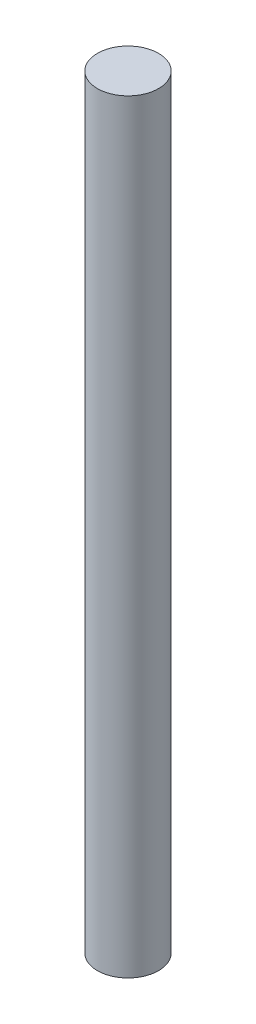
ISO-10303-21;
HEADER;
FILE_DESCRIPTION(('STEP AP214'),'2;1');
FILE_NAME('part.step','',(''),(''),'','','');
FILE_SCHEMA(('AUTOMOTIVE_DESIGN { 1 0 10303 214 1 1 1 1 }'));
ENDSEC;
DATA;
#1=APPLICATION_CONTEXT('core data for automotive mechanical design processes');
#2=APPLICATION_PROTOCOL_DEFINITION('international standard','automotive_design',2000,#1);
#3=PRODUCT_CONTEXT('',#1,'mechanical');
#4=PRODUCT('Part','Part','',(#3));
#5=PRODUCT_RELATED_PRODUCT_CATEGORY('part','',(#4));
#6=PRODUCT_DEFINITION_FORMATION('','',#4);
#7=PRODUCT_DEFINITION_CONTEXT('part definition',#1,'design');
#8=PRODUCT_DEFINITION('design','',#6,#7);
#9=PRODUCT_DEFINITION_SHAPE('','',#8);
#10=(LENGTH_UNIT() NAMED_UNIT(*) SI_UNIT(.MILLI.,.METRE.));
#11=(NAMED_UNIT(*) PLANE_ANGLE_UNIT() SI_UNIT($,.RADIAN.));
#12=(NAMED_UNIT(*) SI_UNIT($,.STERADIAN.) SOLID_ANGLE_UNIT());
#13=UNCERTAINTY_MEASURE_WITH_UNIT(LENGTH_MEASURE(1.E-05),#10,'distance_accuracy_value','');
#14=(GEOMETRIC_REPRESENTATION_CONTEXT(3) GLOBAL_UNCERTAINTY_ASSIGNED_CONTEXT((#13)) GLOBAL_UNIT_ASSIGNED_CONTEXT((#10,
#11,#12)) REPRESENTATION_CONTEXT('',''));
#15=CARTESIAN_POINT('',(0.,0.,0.));
#16=DIRECTION('',(0.,0.,1.));
#17=DIRECTION('',(1.,0.,0.));
#18=AXIS2_PLACEMENT_3D('',#15,#16,#17);
#19=CARTESIAN_POINT('',(0.,100.,0.));
#20=DIRECTION('',(0.,-1.,0.));
#21=DIRECTION('',(0.,0.,-1.));
#22=AXIS2_PLACEMENT_3D('',#19,#20,#21);
#23=CYLINDRICAL_SURFACE('',#22,4.);
#24=CARTESIAN_POINT('',(0.,100.,0.));
#25=DIRECTION('',(0.,1.,0.));
#26=DIRECTION('',(0.,0.,1.));
#27=AXIS2_PLACEMENT_3D('',#24,#25,#26);
#28=CIRCLE('',#27,4.);
#29=CARTESIAN_POINT('',(0.,100.,4.));
#30=VERTEX_POINT('',#29);
#31=EDGE_CURVE('E10',#30,#30,#28,.T.);
#32=ORIENTED_EDGE('',*,*,#31,.F.);
#33=EDGE_LOOP('',(#32));
#34=FACE_BOUND('',#33,.T.);
#35=CARTESIAN_POINT('',(0.,0.,0.));
#36=DIRECTION('',(0.,1.,0.));
#37=DIRECTION('',(0.,0.,1.));
#38=AXIS2_PLACEMENT_3D('',#35,#36,#37);
#39=CIRCLE('',#38,4.);
#40=CARTESIAN_POINT('',(0.,0.,4.));
#41=VERTEX_POINT('',#40);
#42=EDGE_CURVE('E32',#41,#41,#39,.T.);
#43=ORIENTED_EDGE('',*,*,#42,.T.);
#44=EDGE_LOOP('',(#43));
#45=FACE_BOUND('',#44,.T.);
#46=ADVANCED_FACE('F29',(#34,#45),#23,.T.);
#47=CARTESIAN_POINT('',(0.,100.,0.));
#48=DIRECTION('',(0.,1.,0.));
#49=DIRECTION('',(0.,0.,1.));
#50=AXIS2_PLACEMENT_3D('',#47,#48,#49);
#51=PLANE('',#50);
#52=ORIENTED_EDGE('',*,*,#31,.T.);
#53=EDGE_LOOP('',(#52));
#54=FACE_BOUND('',#53,.T.);
#55=ADVANCED_FACE('F44',(#54),#51,.T.);
#56=CARTESIAN_POINT('',(0.,0.,0.));
#57=DIRECTION('',(0.,1.,0.));
#58=DIRECTION('',(0.,0.,1.));
#59=AXIS2_PLACEMENT_3D('',#56,#57,#58);
#60=PLANE('',#59);
#61=ORIENTED_EDGE('',*,*,#42,.F.);
#62=EDGE_LOOP('',(#61));
#63=FACE_BOUND('',#62,.T.);
#64=ADVANCED_FACE('F42',(#63),#60,.F.);
#65=CLOSED_SHELL('',(#46,#55,#64));
#66=MANIFOLD_SOLID_BREP('B2',#65);
#67=ADVANCED_BREP_SHAPE_REPRESENTATION('',(#18,#66),#14);
#68=SHAPE_DEFINITION_REPRESENTATION(#9,#67);
ENDSEC;
END-ISO-10303-21;
